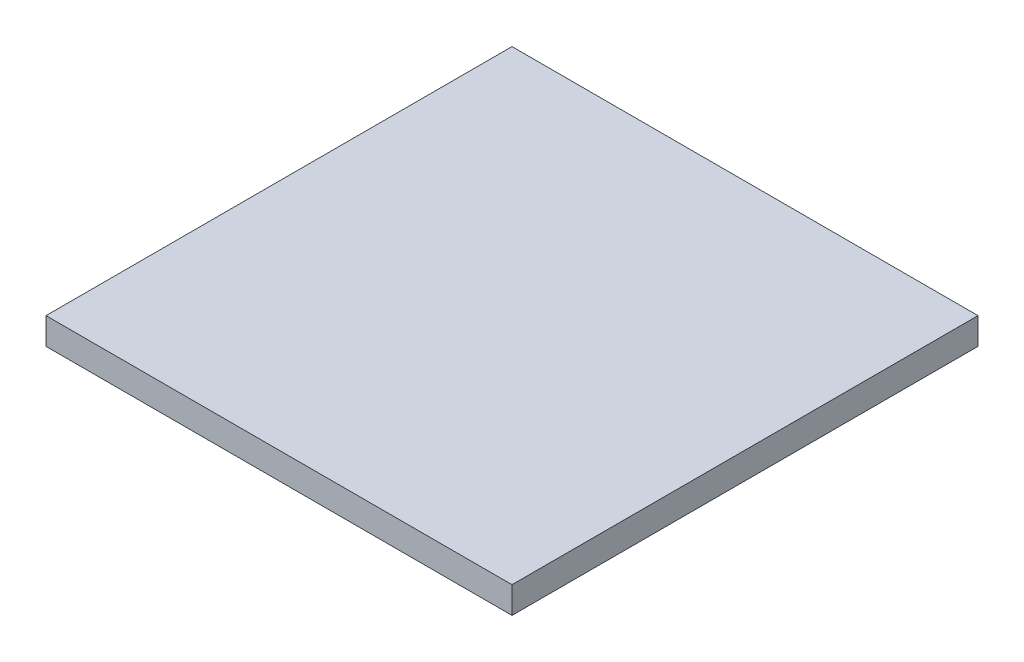
ISO-10303-21;
HEADER;
FILE_DESCRIPTION(('STEP AP214'),'2;1');
FILE_NAME('part.step','',(''),(''),'','','');
FILE_SCHEMA(('AUTOMOTIVE_DESIGN { 1 0 10303 214 1 1 1 1 }'));
ENDSEC;
DATA;
#1=APPLICATION_CONTEXT('core data for automotive mechanical design processes');
#2=APPLICATION_PROTOCOL_DEFINITION('international standard','automotive_design',2000,#1);
#3=PRODUCT_CONTEXT('',#1,'mechanical');
#4=PRODUCT('Part','Part','',(#3));
#5=PRODUCT_RELATED_PRODUCT_CATEGORY('part','',(#4));
#6=PRODUCT_DEFINITION_FORMATION('','',#4);
#7=PRODUCT_DEFINITION_CONTEXT('part definition',#1,'design');
#8=PRODUCT_DEFINITION('design','',#6,#7);
#9=PRODUCT_DEFINITION_SHAPE('','',#8);
#10=(LENGTH_UNIT() NAMED_UNIT(*) SI_UNIT(.MILLI.,.METRE.));
#11=(NAMED_UNIT(*) PLANE_ANGLE_UNIT() SI_UNIT($,.RADIAN.));
#12=(NAMED_UNIT(*) SI_UNIT($,.STERADIAN.) SOLID_ANGLE_UNIT());
#13=UNCERTAINTY_MEASURE_WITH_UNIT(LENGTH_MEASURE(1.E-05),#10,'distance_accuracy_value','');
#14=(GEOMETRIC_REPRESENTATION_CONTEXT(3) GLOBAL_UNCERTAINTY_ASSIGNED_CONTEXT((#13)) GLOBAL_UNIT_ASSIGNED_CONTEXT((#10,
#11,#12)) REPRESENTATION_CONTEXT('',''));
#15=CARTESIAN_POINT('',(0.,0.,0.));
#16=DIRECTION('',(0.,0.,1.));
#17=DIRECTION('',(1.,0.,0.));
#18=AXIS2_PLACEMENT_3D('',#15,#16,#17);
#19=CARTESIAN_POINT('',(17.5,2.,-17.5));
#20=DIRECTION('',(-1.,0.,0.));
#21=DIRECTION('',(0.,0.,1.));
#22=AXIS2_PLACEMENT_3D('',#19,#20,#21);
#23=PLANE('',#22);
#24=DIRECTION('',(0.,0.,-1.));
#25=VECTOR('',#24,1.);
#26=CARTESIAN_POINT('',(17.5,0.,-17.5));
#27=LINE('',#26,#25);
#28=CARTESIAN_POINT('',(17.5,0.,17.5));
#29=VERTEX_POINT('',#28);
#30=CARTESIAN_POINT('',(17.5,0.,-17.5));
#31=VERTEX_POINT('',#30);
#32=EDGE_CURVE('E98',#29,#31,#27,.T.);
#33=ORIENTED_EDGE('',*,*,#32,.T.);
#34=DIRECTION('',(0.,-1.,0.));
#35=VECTOR('',#34,1.);
#36=CARTESIAN_POINT('',(17.5,2.,-17.5));
#37=LINE('',#36,#35);
#38=CARTESIAN_POINT('',(17.5,2.,-17.5));
#39=VERTEX_POINT('',#38);
#40=EDGE_CURVE('E11',#39,#31,#37,.T.);
#41=ORIENTED_EDGE('',*,*,#40,.F.);
#42=DIRECTION('',(0.,0.,-1.));
#43=VECTOR('',#42,1.);
#44=CARTESIAN_POINT('',(17.5,2.,-17.5));
#45=LINE('',#44,#43);
#46=CARTESIAN_POINT('',(17.5,2.,17.5));
#47=VERTEX_POINT('',#46);
#48=EDGE_CURVE('E86',#47,#39,#45,.T.);
#49=ORIENTED_EDGE('',*,*,#48,.F.);
#50=DIRECTION('',(0.,-1.,0.));
#51=VECTOR('',#50,1.);
#52=CARTESIAN_POINT('',(17.5,2.,17.5));
#53=LINE('',#52,#51);
#54=EDGE_CURVE('E94',#47,#29,#53,.T.);
#55=ORIENTED_EDGE('',*,*,#54,.T.);
#56=EDGE_LOOP('',(#33,#41,#49,#55));
#57=FACE_BOUND('',#56,.T.);
#58=ADVANCED_FACE('F35',(#57),#23,.F.);
#59=CARTESIAN_POINT('',(-17.5,2.,-17.5));
#60=DIRECTION('',(0.,0.,1.));
#61=DIRECTION('',(1.,0.,0.));
#62=AXIS2_PLACEMENT_3D('',#59,#60,#61);
#63=PLANE('',#62);
#64=DIRECTION('',(-1.,0.,0.));
#65=VECTOR('',#64,1.);
#66=CARTESIAN_POINT('',(-17.5,0.,-17.5));
#67=LINE('',#66,#65);
#68=CARTESIAN_POINT('',(-17.5,0.,-17.5));
#69=VERTEX_POINT('',#68);
#70=EDGE_CURVE('E90',#31,#69,#67,.T.);
#71=ORIENTED_EDGE('',*,*,#70,.T.);
#72=DIRECTION('',(0.,-1.,0.));
#73=VECTOR('',#72,1.);
#74=CARTESIAN_POINT('',(-17.5,2.,-17.5));
#75=LINE('',#74,#73);
#76=CARTESIAN_POINT('',(-17.5,2.,-17.5));
#77=VERTEX_POINT('',#76);
#78=EDGE_CURVE('E43',#77,#69,#75,.T.);
#79=ORIENTED_EDGE('',*,*,#78,.F.);
#80=DIRECTION('',(-1.,0.,0.));
#81=VECTOR('',#80,1.);
#82=CARTESIAN_POINT('',(-17.5,2.,-17.5));
#83=LINE('',#82,#81);
#84=EDGE_CURVE('E81',#39,#77,#83,.T.);
#85=ORIENTED_EDGE('',*,*,#84,.F.);
#86=ORIENTED_EDGE('',*,*,#40,.T.);
#87=EDGE_LOOP('',(#71,#79,#85,#86));
#88=FACE_BOUND('',#87,.T.);
#89=ADVANCED_FACE('F89',(#88),#63,.F.);
#90=CARTESIAN_POINT('',(-17.5,2.,-17.5));
#91=DIRECTION('',(1.,0.,0.));
#92=DIRECTION('',(0.,0.,-1.));
#93=AXIS2_PLACEMENT_3D('',#90,#91,#92);
#94=PLANE('',#93);
#95=DIRECTION('',(0.,0.,1.));
#96=VECTOR('',#95,1.);
#97=CARTESIAN_POINT('',(-17.5,0.,-17.5));
#98=LINE('',#97,#96);
#99=CARTESIAN_POINT('',(-17.5,0.,17.5));
#100=VERTEX_POINT('',#99);
#101=EDGE_CURVE('E68',#69,#100,#98,.T.);
#102=ORIENTED_EDGE('',*,*,#101,.T.);
#103=DIRECTION('',(0.,-1.,0.));
#104=VECTOR('',#103,1.);
#105=CARTESIAN_POINT('',(-17.5,2.,17.5));
#106=LINE('',#105,#104);
#107=CARTESIAN_POINT('',(-17.5,2.,17.5));
#108=VERTEX_POINT('',#107);
#109=EDGE_CURVE('E91',#108,#100,#106,.T.);
#110=ORIENTED_EDGE('',*,*,#109,.F.);
#111=DIRECTION('',(0.,0.,1.));
#112=VECTOR('',#111,1.);
#113=CARTESIAN_POINT('',(-17.5,2.,-17.5));
#114=LINE('',#113,#112);
#115=EDGE_CURVE('E84',#77,#108,#114,.T.);
#116=ORIENTED_EDGE('',*,*,#115,.F.);
#117=ORIENTED_EDGE('',*,*,#78,.T.);
#118=EDGE_LOOP('',(#102,#110,#116,#117));
#119=FACE_BOUND('',#118,.T.);
#120=ADVANCED_FACE('F92',(#119),#94,.F.);
#121=CARTESIAN_POINT('',(-17.5,2.,17.5));
#122=DIRECTION('',(0.,0.,-1.));
#123=DIRECTION('',(-1.,0.,0.));
#124=AXIS2_PLACEMENT_3D('',#121,#122,#123);
#125=PLANE('',#124);
#126=DIRECTION('',(1.,0.,0.));
#127=VECTOR('',#126,1.);
#128=CARTESIAN_POINT('',(-17.5,0.,17.5));
#129=LINE('',#128,#127);
#130=EDGE_CURVE('E74',#100,#29,#129,.T.);
#131=ORIENTED_EDGE('',*,*,#130,.T.);
#132=ORIENTED_EDGE('',*,*,#54,.F.);
#133=DIRECTION('',(1.,0.,0.));
#134=VECTOR('',#133,1.);
#135=CARTESIAN_POINT('',(-17.5,2.,17.5));
#136=LINE('',#135,#134);
#137=EDGE_CURVE('E51',#108,#47,#136,.T.);
#138=ORIENTED_EDGE('',*,*,#137,.F.);
#139=ORIENTED_EDGE('',*,*,#109,.T.);
#140=EDGE_LOOP('',(#131,#132,#138,#139));
#141=FACE_BOUND('',#140,.T.);
#142=ADVANCED_FACE('F105',(#141),#125,.F.);
#143=CARTESIAN_POINT('',(0.,2.,0.));
#144=DIRECTION('',(0.,1.,0.));
#145=DIRECTION('',(0.,0.,1.));
#146=AXIS2_PLACEMENT_3D('',#143,#144,#145);
#147=PLANE('',#146);
#148=ORIENTED_EDGE('',*,*,#48,.T.);
#149=ORIENTED_EDGE('',*,*,#84,.T.);
#150=ORIENTED_EDGE('',*,*,#115,.T.);
#151=ORIENTED_EDGE('',*,*,#137,.T.);
#152=EDGE_LOOP('',(#148,#149,#150,#151));
#153=FACE_BOUND('',#152,.T.);
#154=ADVANCED_FACE('F82',(#153),#147,.T.);
#155=CARTESIAN_POINT('',(0.,0.,0.));
#156=DIRECTION('',(0.,1.,0.));
#157=DIRECTION('',(0.,0.,1.));
#158=AXIS2_PLACEMENT_3D('',#155,#156,#157);
#159=PLANE('',#158);
#160=ORIENTED_EDGE('',*,*,#32,.F.);
#161=ORIENTED_EDGE('',*,*,#130,.F.);
#162=ORIENTED_EDGE('',*,*,#101,.F.);
#163=ORIENTED_EDGE('',*,*,#70,.F.);
#164=EDGE_LOOP('',(#160,#161,#162,#163));
#165=FACE_BOUND('',#164,.T.);
#166=ADVANCED_FACE('F108',(#165),#159,.F.);
#167=CLOSED_SHELL('',(#58,#89,#120,#142,#154,#166));
#168=MANIFOLD_SOLID_BREP('B2',#167);
#169=ADVANCED_BREP_SHAPE_REPRESENTATION('',(#18,#168),#14);
#170=SHAPE_DEFINITION_REPRESENTATION(#9,#169);
ENDSEC;
END-ISO-10303-21;
